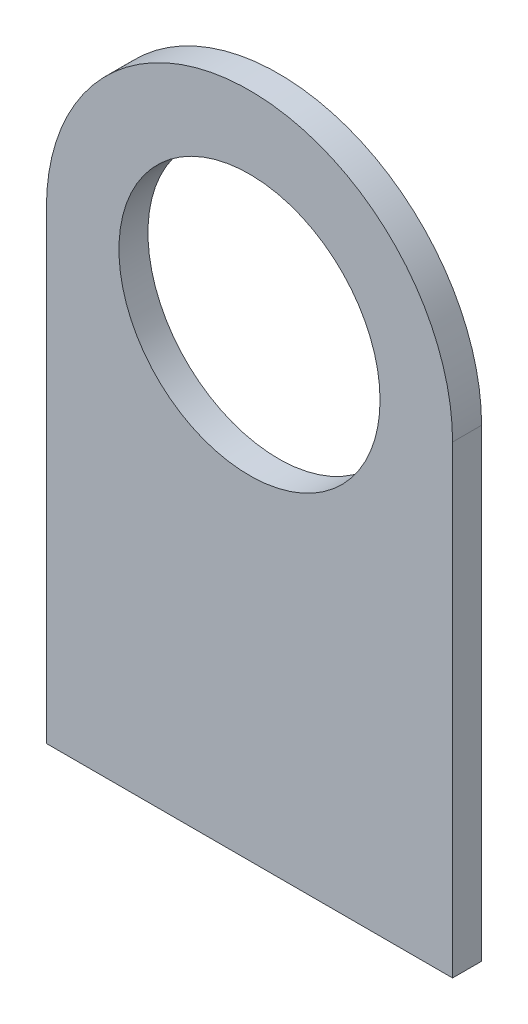
ISO-10303-21;
HEADER;
FILE_DESCRIPTION(('STEP AP214'),'2;1');
FILE_NAME('part.step','',(''),(''),'','','');
FILE_SCHEMA(('AUTOMOTIVE_DESIGN { 1 0 10303 214 1 1 1 1 }'));
ENDSEC;
DATA;
#1=APPLICATION_CONTEXT('core data for automotive mechanical design processes');
#2=APPLICATION_PROTOCOL_DEFINITION('international standard','automotive_design',2000,#1);
#3=PRODUCT_CONTEXT('',#1,'mechanical');
#4=PRODUCT('Part','Part','',(#3));
#5=PRODUCT_RELATED_PRODUCT_CATEGORY('part','',(#4));
#6=PRODUCT_DEFINITION_FORMATION('','',#4);
#7=PRODUCT_DEFINITION_CONTEXT('part definition',#1,'design');
#8=PRODUCT_DEFINITION('design','',#6,#7);
#9=PRODUCT_DEFINITION_SHAPE('','',#8);
#10=(LENGTH_UNIT() NAMED_UNIT(*) SI_UNIT(.MILLI.,.METRE.));
#11=(NAMED_UNIT(*) PLANE_ANGLE_UNIT() SI_UNIT($,.RADIAN.));
#12=(NAMED_UNIT(*) SI_UNIT($,.STERADIAN.) SOLID_ANGLE_UNIT());
#13=UNCERTAINTY_MEASURE_WITH_UNIT(LENGTH_MEASURE(1.E-05),#10,'distance_accuracy_value','');
#14=(GEOMETRIC_REPRESENTATION_CONTEXT(3) GLOBAL_UNCERTAINTY_ASSIGNED_CONTEXT((#13)) GLOBAL_UNIT_ASSIGNED_CONTEXT((#10,
#11,#12)) REPRESENTATION_CONTEXT('',''));
#15=CARTESIAN_POINT('',(0.,0.,0.));
#16=DIRECTION('',(0.,0.,1.));
#17=DIRECTION('',(1.,0.,0.));
#18=AXIS2_PLACEMENT_3D('',#15,#16,#17);
#19=CARTESIAN_POINT('',(0.,0.,3.175));
#20=DIRECTION('',(0.,0.,1.));
#21=DIRECTION('',(1.,0.,0.));
#22=AXIS2_PLACEMENT_3D('',#19,#20,#21);
#23=PLANE('',#22);
#24=CARTESIAN_POINT('',(0.,0.,3.175));
#25=DIRECTION('',(0.,0.,1.));
#26=DIRECTION('',(1.,0.,0.));
#27=AXIS2_PLACEMENT_3D('',#24,#25,#26);
#28=CIRCLE('',#27,22.225);
#29=CARTESIAN_POINT('',(22.225,0.,3.175));
#30=VERTEX_POINT('',#29);
#31=CARTESIAN_POINT('',(-22.225,0.,3.175));
#32=VERTEX_POINT('',#31);
#33=EDGE_CURVE('E91',#30,#32,#28,.T.);
#34=ORIENTED_EDGE('',*,*,#33,.T.);
#35=DIRECTION('',(0.,-1.,0.));
#36=VECTOR('',#35,1.);
#37=CARTESIAN_POINT('',(-22.225,0.,3.175));
#38=LINE('',#37,#36);
#39=CARTESIAN_POINT('',(-22.225,-50.8,3.175));
#40=VERTEX_POINT('',#39);
#41=EDGE_CURVE('E86',#32,#40,#38,.T.);
#42=ORIENTED_EDGE('',*,*,#41,.T.);
#43=DIRECTION('',(1.,0.,0.));
#44=VECTOR('',#43,1.);
#45=CARTESIAN_POINT('',(-22.225,-50.8,3.175));
#46=LINE('',#45,#44);
#47=CARTESIAN_POINT('',(22.225,-50.8,3.175));
#48=VERTEX_POINT('',#47);
#49=EDGE_CURVE('E89',#40,#48,#46,.T.);
#50=ORIENTED_EDGE('',*,*,#49,.T.);
#51=DIRECTION('',(0.,1.,0.));
#52=VECTOR('',#51,1.);
#53=CARTESIAN_POINT('',(22.225,-50.8,3.175));
#54=LINE('',#53,#52);
#55=EDGE_CURVE('E56',#48,#30,#54,.T.);
#56=ORIENTED_EDGE('',*,*,#55,.T.);
#57=EDGE_LOOP('',(#34,#42,#50,#56));
#58=FACE_BOUND('',#57,.T.);
#59=CARTESIAN_POINT('',(0.,0.,3.175));
#60=DIRECTION('',(0.,0.,1.));
#61=DIRECTION('',(1.,0.,0.));
#62=AXIS2_PLACEMENT_3D('',#59,#60,#61);
#63=CIRCLE('',#62,14.2875);
#64=CARTESIAN_POINT('',(14.2875,0.,3.175));
#65=VERTEX_POINT('',#64);
#66=EDGE_CURVE('E106',#65,#65,#63,.T.);
#67=ORIENTED_EDGE('',*,*,#66,.F.);
#68=EDGE_LOOP('',(#67));
#69=FACE_BOUND('',#68,.T.);
#70=ADVANCED_FACE('F39',(#58,#69),#23,.T.);
#71=CARTESIAN_POINT('',(0.,0.,0.));
#72=DIRECTION('',(0.,0.,1.));
#73=DIRECTION('',(1.,0.,0.));
#74=AXIS2_PLACEMENT_3D('',#71,#72,#73);
#75=PLANE('',#74);
#76=CARTESIAN_POINT('',(0.,0.,0.));
#77=DIRECTION('',(0.,0.,1.));
#78=DIRECTION('',(1.,0.,0.));
#79=AXIS2_PLACEMENT_3D('',#76,#77,#78);
#80=CIRCLE('',#79,22.225);
#81=CARTESIAN_POINT('',(22.225,0.,0.));
#82=VERTEX_POINT('',#81);
#83=CARTESIAN_POINT('',(-22.225,0.,0.));
#84=VERTEX_POINT('',#83);
#85=EDGE_CURVE('E103',#82,#84,#80,.T.);
#86=ORIENTED_EDGE('',*,*,#85,.F.);
#87=DIRECTION('',(0.,1.,0.));
#88=VECTOR('',#87,1.);
#89=CARTESIAN_POINT('',(22.225,-50.8,0.));
#90=LINE('',#89,#88);
#91=CARTESIAN_POINT('',(22.225,-50.8,0.));
#92=VERTEX_POINT('',#91);
#93=EDGE_CURVE('E79',#92,#82,#90,.T.);
#94=ORIENTED_EDGE('',*,*,#93,.F.);
#95=DIRECTION('',(1.,0.,0.));
#96=VECTOR('',#95,1.);
#97=CARTESIAN_POINT('',(-22.225,-50.8,0.));
#98=LINE('',#97,#96);
#99=CARTESIAN_POINT('',(-22.225,-50.8,0.));
#100=VERTEX_POINT('',#99);
#101=EDGE_CURVE('E73',#100,#92,#98,.T.);
#102=ORIENTED_EDGE('',*,*,#101,.F.);
#103=DIRECTION('',(0.,-1.,0.));
#104=VECTOR('',#103,1.);
#105=CARTESIAN_POINT('',(-22.225,0.,0.));
#106=LINE('',#105,#104);
#107=EDGE_CURVE('E95',#84,#100,#106,.T.);
#108=ORIENTED_EDGE('',*,*,#107,.F.);
#109=EDGE_LOOP('',(#86,#94,#102,#108));
#110=FACE_BOUND('',#109,.T.);
#111=CARTESIAN_POINT('',(0.,0.,0.));
#112=DIRECTION('',(0.,0.,1.));
#113=DIRECTION('',(1.,0.,0.));
#114=AXIS2_PLACEMENT_3D('',#111,#112,#113);
#115=CIRCLE('',#114,14.2875);
#116=CARTESIAN_POINT('',(14.2875,0.,0.));
#117=VERTEX_POINT('',#116);
#118=EDGE_CURVE('E118',#117,#117,#115,.T.);
#119=ORIENTED_EDGE('',*,*,#118,.T.);
#120=EDGE_LOOP('',(#119));
#121=FACE_BOUND('',#120,.T.);
#122=ADVANCED_FACE('F114',(#110,#121),#75,.F.);
#123=CARTESIAN_POINT('',(0.,0.,3.175));
#124=DIRECTION('',(0.,0.,-1.));
#125=DIRECTION('',(-1.,0.,0.));
#126=AXIS2_PLACEMENT_3D('',#123,#124,#125);
#127=CYLINDRICAL_SURFACE('',#126,22.225);
#128=ORIENTED_EDGE('',*,*,#85,.T.);
#129=DIRECTION('',(0.,0.,-1.));
#130=VECTOR('',#129,1.);
#131=CARTESIAN_POINT('',(-22.225,0.,3.175));
#132=LINE('',#131,#130);
#133=EDGE_CURVE('E11',#32,#84,#132,.T.);
#134=ORIENTED_EDGE('',*,*,#133,.F.);
#135=ORIENTED_EDGE('',*,*,#33,.F.);
#136=DIRECTION('',(0.,0.,-1.));
#137=VECTOR('',#136,1.);
#138=CARTESIAN_POINT('',(22.225,0.,3.175));
#139=LINE('',#138,#137);
#140=EDGE_CURVE('E99',#30,#82,#139,.T.);
#141=ORIENTED_EDGE('',*,*,#140,.T.);
#142=EDGE_LOOP('',(#128,#134,#135,#141));
#143=FACE_BOUND('',#142,.T.);
#144=ADVANCED_FACE('F41',(#143),#127,.T.);
#145=CARTESIAN_POINT('',(-22.225,0.,3.175));
#146=DIRECTION('',(1.,0.,0.));
#147=DIRECTION('',(0.,0.,-1.));
#148=AXIS2_PLACEMENT_3D('',#145,#146,#147);
#149=PLANE('',#148);
#150=ORIENTED_EDGE('',*,*,#107,.T.);
#151=DIRECTION('',(0.,0.,-1.));
#152=VECTOR('',#151,1.);
#153=CARTESIAN_POINT('',(-22.225,-50.8,3.175));
#154=LINE('',#153,#152);
#155=EDGE_CURVE('E48',#40,#100,#154,.T.);
#156=ORIENTED_EDGE('',*,*,#155,.F.);
#157=ORIENTED_EDGE('',*,*,#41,.F.);
#158=ORIENTED_EDGE('',*,*,#133,.T.);
#159=EDGE_LOOP('',(#150,#156,#157,#158));
#160=FACE_BOUND('',#159,.T.);
#161=ADVANCED_FACE('F94',(#160),#149,.F.);
#162=CARTESIAN_POINT('',(-22.225,-50.8,3.175));
#163=DIRECTION('',(0.,1.,0.));
#164=DIRECTION('',(0.,0.,1.));
#165=AXIS2_PLACEMENT_3D('',#162,#163,#164);
#166=PLANE('',#165);
#167=ORIENTED_EDGE('',*,*,#101,.T.);
#168=DIRECTION('',(0.,0.,-1.));
#169=VECTOR('',#168,1.);
#170=CARTESIAN_POINT('',(22.225,-50.8,3.175));
#171=LINE('',#170,#169);
#172=EDGE_CURVE('E96',#48,#92,#171,.T.);
#173=ORIENTED_EDGE('',*,*,#172,.F.);
#174=ORIENTED_EDGE('',*,*,#49,.F.);
#175=ORIENTED_EDGE('',*,*,#155,.T.);
#176=EDGE_LOOP('',(#167,#173,#174,#175));
#177=FACE_BOUND('',#176,.T.);
#178=ADVANCED_FACE('F97',(#177),#166,.F.);
#179=CARTESIAN_POINT('',(22.225,-50.8,3.175));
#180=DIRECTION('',(-1.,0.,0.));
#181=DIRECTION('',(0.,0.,1.));
#182=AXIS2_PLACEMENT_3D('',#179,#180,#181);
#183=PLANE('',#182);
#184=ORIENTED_EDGE('',*,*,#93,.T.);
#185=ORIENTED_EDGE('',*,*,#140,.F.);
#186=ORIENTED_EDGE('',*,*,#55,.F.);
#187=ORIENTED_EDGE('',*,*,#172,.T.);
#188=EDGE_LOOP('',(#184,#185,#186,#187));
#189=FACE_BOUND('',#188,.T.);
#190=ADVANCED_FACE('F111',(#189),#183,.F.);
#191=CARTESIAN_POINT('',(0.,0.,3.175));
#192=DIRECTION('',(0.,0.,-1.));
#193=DIRECTION('',(-1.,0.,0.));
#194=AXIS2_PLACEMENT_3D('',#191,#192,#193);
#195=CYLINDRICAL_SURFACE('',#194,14.2875);
#196=ORIENTED_EDGE('',*,*,#66,.T.);
#197=EDGE_LOOP('',(#196));
#198=FACE_BOUND('',#197,.T.);
#199=ORIENTED_EDGE('',*,*,#118,.F.);
#200=EDGE_LOOP('',(#199));
#201=FACE_BOUND('',#200,.T.);
#202=ADVANCED_FACE('F124',(#198,#201),#195,.F.);
#203=CLOSED_SHELL('',(#70,#122,#144,#161,#178,#190,#202));
#204=MANIFOLD_SOLID_BREP('B2',#203);
#205=ADVANCED_BREP_SHAPE_REPRESENTATION('',(#18,#204),#14);
#206=SHAPE_DEFINITION_REPRESENTATION(#9,#205);
ENDSEC;
END-ISO-10303-21;
